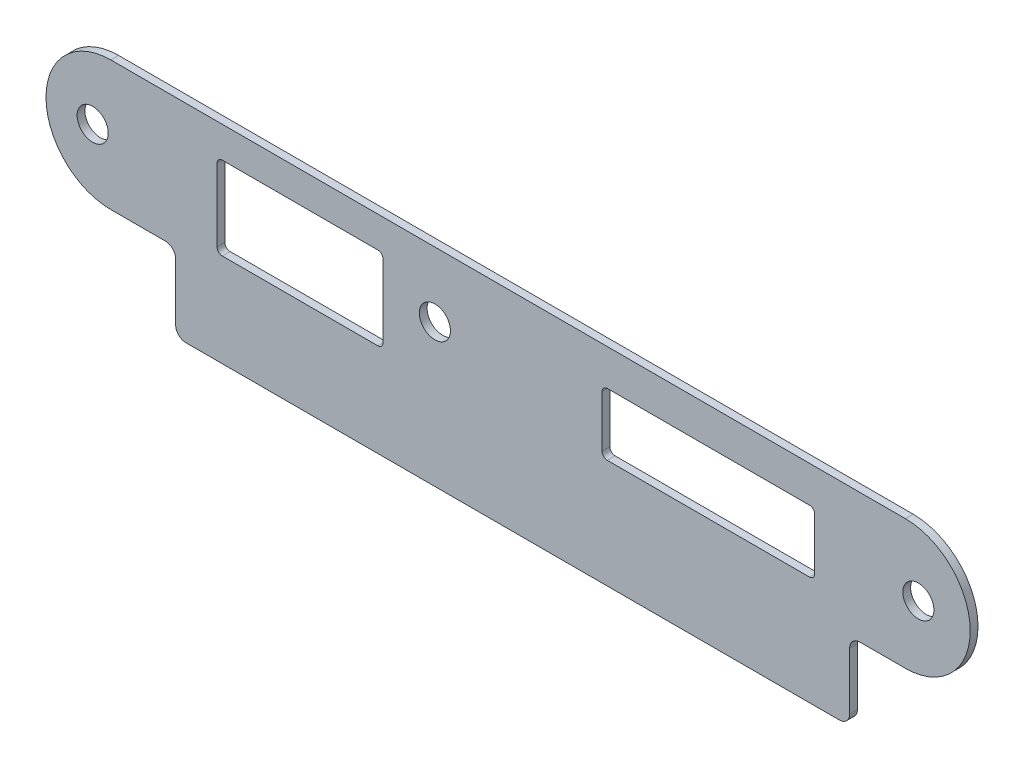
ISO-10303-21;
HEADER;
FILE_DESCRIPTION(('STEP AP214'),'2;1');
FILE_NAME('part.step','',(''),(''),'','','');
FILE_SCHEMA(('AUTOMOTIVE_DESIGN { 1 0 10303 214 1 1 1 1 }'));
ENDSEC;
DATA;
#1=APPLICATION_CONTEXT('core data for automotive mechanical design processes');
#2=APPLICATION_PROTOCOL_DEFINITION('international standard','automotive_design',2000,#1);
#3=PRODUCT_CONTEXT('',#1,'mechanical');
#4=PRODUCT('Part','Part','',(#3));
#5=PRODUCT_RELATED_PRODUCT_CATEGORY('part','',(#4));
#6=PRODUCT_DEFINITION_FORMATION('','',#4);
#7=PRODUCT_DEFINITION_CONTEXT('part definition',#1,'design');
#8=PRODUCT_DEFINITION('design','',#6,#7);
#9=PRODUCT_DEFINITION_SHAPE('','',#8);
#10=(LENGTH_UNIT() NAMED_UNIT(*) SI_UNIT(.MILLI.,.METRE.));
#11=(NAMED_UNIT(*) PLANE_ANGLE_UNIT() SI_UNIT($,.RADIAN.));
#12=(NAMED_UNIT(*) SI_UNIT($,.STERADIAN.) SOLID_ANGLE_UNIT());
#13=UNCERTAINTY_MEASURE_WITH_UNIT(LENGTH_MEASURE(1.E-05),#10,'distance_accuracy_value','');
#14=(GEOMETRIC_REPRESENTATION_CONTEXT(3) GLOBAL_UNCERTAINTY_ASSIGNED_CONTEXT((#13)) GLOBAL_UNIT_ASSIGNED_CONTEXT((#10,
#11,#12)) REPRESENTATION_CONTEXT('',''));
#15=CARTESIAN_POINT('',(0.,0.,0.));
#16=DIRECTION('',(0.,0.,1.));
#17=DIRECTION('',(1.,0.,0.));
#18=AXIS2_PLACEMENT_3D('',#15,#16,#17);
#19=CARTESIAN_POINT('',(-83.,6.50000000000004,1.5));
#20=DIRECTION('',(0.,0.,1.));
#21=DIRECTION('',(1.,0.,0.));
#22=AXIS2_PLACEMENT_3D('',#19,#20,#21);
#23=PLANE('',#22);
#24=DIRECTION('',(-1.,0.,0.));
#25=VECTOR('',#24,1.);
#26=CARTESIAN_POINT('',(51.75,12.0000000000001,1.5));
#27=LINE('',#26,#25);
#28=CARTESIAN_POINT('',(51.75,12.0000000000001,1.5));
#29=VERTEX_POINT('',#28);
#30=CARTESIAN_POINT('',(12.75,12.,1.5));
#31=VERTEX_POINT('',#30);
#32=EDGE_CURVE('E229',#29,#31,#27,.T.);
#33=ORIENTED_EDGE('',*,*,#32,.F.);
#34=CARTESIAN_POINT('',(51.75,11.,1.5));
#35=DIRECTION('',(0.,0.,1.));
#36=DIRECTION('',(1.,0.,0.));
#37=AXIS2_PLACEMENT_3D('',#34,#35,#36);
#38=CIRCLE('',#37,1.00000000000002);
#39=CARTESIAN_POINT('',(52.75,11.,1.5));
#40=VERTEX_POINT('',#39);
#41=EDGE_CURVE('E221',#40,#29,#38,.T.);
#42=ORIENTED_EDGE('',*,*,#41,.F.);
#43=DIRECTION('',(0.,1.,0.));
#44=VECTOR('',#43,1.);
#45=CARTESIAN_POINT('',(52.75,1.00000000000005,1.5));
#46=LINE('',#45,#44);
#47=CARTESIAN_POINT('',(52.75,1.00000000000005,1.5));
#48=VERTEX_POINT('',#47);
#49=EDGE_CURVE('E256',#48,#40,#46,.T.);
#50=ORIENTED_EDGE('',*,*,#49,.F.);
#51=CARTESIAN_POINT('',(51.75,1.00000000000004,1.5));
#52=DIRECTION('',(0.,0.,1.));
#53=DIRECTION('',(1.,0.,0.));
#54=AXIS2_PLACEMENT_3D('',#51,#52,#53);
#55=CIRCLE('',#54,0.999999999999997);
#56=CARTESIAN_POINT('',(51.75,0.,1.5));
#57=VERTEX_POINT('',#56);
#58=EDGE_CURVE('E254',#57,#48,#55,.T.);
#59=ORIENTED_EDGE('',*,*,#58,.F.);
#60=DIRECTION('',(1.,0.,0.));
#61=VECTOR('',#60,1.);
#62=CARTESIAN_POINT('',(12.75,0.,1.5));
#63=LINE('',#62,#61);
#64=CARTESIAN_POINT('',(12.75,0.,1.5));
#65=VERTEX_POINT('',#64);
#66=EDGE_CURVE('E252',#65,#57,#63,.T.);
#67=ORIENTED_EDGE('',*,*,#66,.F.);
#68=CARTESIAN_POINT('',(12.75,1.00000000000004,1.5));
#69=DIRECTION('',(0.,0.,1.));
#70=DIRECTION('',(1.,0.,0.));
#71=AXIS2_PLACEMENT_3D('',#68,#69,#70);
#72=CIRCLE('',#71,0.999999999999999);
#73=CARTESIAN_POINT('',(11.75,1.00000000000004,1.5));
#74=VERTEX_POINT('',#73);
#75=EDGE_CURVE('E250',#74,#65,#72,.T.);
#76=ORIENTED_EDGE('',*,*,#75,.F.);
#77=DIRECTION('',(0.,-1.,0.));
#78=VECTOR('',#77,1.);
#79=CARTESIAN_POINT('',(11.75,11.,1.5));
#80=LINE('',#79,#78);
#81=CARTESIAN_POINT('',(11.75,11.,1.5));
#82=VERTEX_POINT('',#81);
#83=EDGE_CURVE('E245',#82,#74,#80,.T.);
#84=ORIENTED_EDGE('',*,*,#83,.F.);
#85=CARTESIAN_POINT('',(12.75,11.,1.5));
#86=DIRECTION('',(0.,0.,1.));
#87=DIRECTION('',(1.,0.,0.));
#88=AXIS2_PLACEMENT_3D('',#85,#86,#87);
#89=CIRCLE('',#88,1.);
#90=EDGE_CURVE('E243',#31,#82,#89,.T.);
#91=ORIENTED_EDGE('',*,*,#90,.F.);
#92=EDGE_LOOP('',(#33,#42,#50,#59,#67,#76,#84,#91));
#93=FACE_BOUND('',#92,.T.);
#94=DIRECTION('',(0.,-1.,0.));
#95=VECTOR('',#94,1.);
#96=CARTESIAN_POINT('',(-62.5,12.,1.5));
#97=LINE('',#96,#95);
#98=CARTESIAN_POINT('',(-62.5,12.,1.5));
#99=VERTEX_POINT('',#98);
#100=CARTESIAN_POINT('',(-62.5,-2.00000000000002,1.5));
#101=VERTEX_POINT('',#100);
#102=EDGE_CURVE('E297',#99,#101,#97,.T.);
#103=ORIENTED_EDGE('',*,*,#102,.F.);
#104=CARTESIAN_POINT('',(-61.5,12.,1.5));
#105=DIRECTION('',(0.,0.,1.));
#106=DIRECTION('',(1.,0.,0.));
#107=AXIS2_PLACEMENT_3D('',#104,#105,#106);
#108=CIRCLE('',#107,1.);
#109=CARTESIAN_POINT('',(-61.5,13.,1.5));
#110=VERTEX_POINT('',#109);
#111=EDGE_CURVE('E295',#110,#99,#108,.T.);
#112=ORIENTED_EDGE('',*,*,#111,.F.);
#113=DIRECTION('',(-1.,0.,0.));
#114=VECTOR('',#113,1.);
#115=CARTESIAN_POINT('',(-31.5,13.,1.5));
#116=LINE('',#115,#114);
#117=CARTESIAN_POINT('',(-31.5,13.,1.5));
#118=VERTEX_POINT('',#117);
#119=EDGE_CURVE('E311',#118,#110,#116,.T.);
#120=ORIENTED_EDGE('',*,*,#119,.F.);
#121=CARTESIAN_POINT('',(-31.5,12.,1.5));
#122=DIRECTION('',(0.,0.,1.));
#123=DIRECTION('',(1.,0.,0.));
#124=AXIS2_PLACEMENT_3D('',#121,#122,#123);
#125=CIRCLE('',#124,0.999999999999991);
#126=CARTESIAN_POINT('',(-30.5,12.,1.5));
#127=VERTEX_POINT('',#126);
#128=EDGE_CURVE('E308',#127,#118,#125,.T.);
#129=ORIENTED_EDGE('',*,*,#128,.F.);
#130=DIRECTION('',(0.,1.,0.));
#131=VECTOR('',#130,1.);
#132=CARTESIAN_POINT('',(-30.5,-2.00000000000002,1.5));
#133=LINE('',#132,#131);
#134=CARTESIAN_POINT('',(-30.5,-2.00000000000002,1.5));
#135=VERTEX_POINT('',#134);
#136=EDGE_CURVE('E306',#135,#127,#133,.T.);
#137=ORIENTED_EDGE('',*,*,#136,.F.);
#138=CARTESIAN_POINT('',(-31.5,-2.00000000000002,1.5));
#139=DIRECTION('',(0.,0.,1.));
#140=DIRECTION('',(1.,0.,0.));
#141=AXIS2_PLACEMENT_3D('',#138,#139,#140);
#142=CIRCLE('',#141,1.);
#143=CARTESIAN_POINT('',(-31.5,-3.00000000000002,1.5));
#144=VERTEX_POINT('',#143);
#145=EDGE_CURVE('E304',#144,#135,#142,.T.);
#146=ORIENTED_EDGE('',*,*,#145,.F.);
#147=DIRECTION('',(1.,0.,0.));
#148=VECTOR('',#147,1.);
#149=CARTESIAN_POINT('',(-61.5,-3.00000000000003,1.5));
#150=LINE('',#149,#148);
#151=CARTESIAN_POINT('',(-61.5,-3.00000000000003,1.5));
#152=VERTEX_POINT('',#151);
#153=EDGE_CURVE('E302',#152,#144,#150,.T.);
#154=ORIENTED_EDGE('',*,*,#153,.F.);
#155=CARTESIAN_POINT('',(-61.5,-2.00000000000003,1.5));
#156=DIRECTION('',(0.,0.,1.));
#157=DIRECTION('',(1.,0.,0.));
#158=AXIS2_PLACEMENT_3D('',#155,#156,#157);
#159=CIRCLE('',#158,1.);
#160=EDGE_CURVE('E300',#101,#152,#159,.T.);
#161=ORIENTED_EDGE('',*,*,#160,.F.);
#162=EDGE_LOOP('',(#103,#112,#120,#129,#137,#146,#154,#161));
#163=FACE_BOUND('',#162,.T.);
#164=CARTESIAN_POINT('',(-83.,6.50000000000004,1.5));
#165=DIRECTION('',(0.,0.,1.));
#166=DIRECTION('',(1.,0.,0.));
#167=AXIS2_PLACEMENT_3D('',#164,#165,#166);
#168=CIRCLE('',#167,12.5);
#169=CARTESIAN_POINT('',(-83.,19.,1.5));
#170=VERTEX_POINT('',#169);
#171=CARTESIAN_POINT('',(-83.,-5.99999999999994,1.5));
#172=VERTEX_POINT('',#171);
#173=EDGE_CURVE('E361',#170,#172,#168,.T.);
#174=ORIENTED_EDGE('',*,*,#173,.T.);
#175=DIRECTION('',(1.,0.,0.));
#176=VECTOR('',#175,1.);
#177=CARTESIAN_POINT('',(-83.,-5.99999999999994,1.5));
#178=LINE('',#177,#176);
#179=CARTESIAN_POINT('',(-72.5,-6.00000000000005,1.5));
#180=VERTEX_POINT('',#179);
#181=EDGE_CURVE('E364',#172,#180,#178,.T.);
#182=ORIENTED_EDGE('',*,*,#181,.T.);
#183=CARTESIAN_POINT('',(-72.5,-8.00000000000005,1.5));
#184=DIRECTION('',(0.,0.,-1.));
#185=DIRECTION('',(1.,0.,0.));
#186=AXIS2_PLACEMENT_3D('',#183,#184,#185);
#187=CIRCLE('',#186,2.);
#188=CARTESIAN_POINT('',(-70.5,-8.00000000000005,1.5));
#189=VERTEX_POINT('',#188);
#190=EDGE_CURVE('E367',#180,#189,#187,.T.);
#191=ORIENTED_EDGE('',*,*,#190,.T.);
#192=DIRECTION('',(0.,-1.,0.));
#193=VECTOR('',#192,1.);
#194=CARTESIAN_POINT('',(-70.5,-8.00000000000005,1.5));
#195=LINE('',#194,#193);
#196=CARTESIAN_POINT('',(-70.5,-19.,1.5));
#197=VERTEX_POINT('',#196);
#198=EDGE_CURVE('E369',#189,#197,#195,.T.);
#199=ORIENTED_EDGE('',*,*,#198,.T.);
#200=CARTESIAN_POINT('',(-68.5,-19.,1.5));
#201=DIRECTION('',(0.,0.,1.));
#202=DIRECTION('',(1.,0.,0.));
#203=AXIS2_PLACEMENT_3D('',#200,#201,#202);
#204=CIRCLE('',#203,2.00000000000001);
#205=CARTESIAN_POINT('',(-68.5,-21.,1.5));
#206=VERTEX_POINT('',#205);
#207=EDGE_CURVE('E371',#197,#206,#204,.T.);
#208=ORIENTED_EDGE('',*,*,#207,.T.);
#209=DIRECTION('',(1.,0.,0.));
#210=VECTOR('',#209,1.);
#211=CARTESIAN_POINT('',(-68.5,-21.,1.5));
#212=LINE('',#211,#210);
#213=CARTESIAN_POINT('',(57.5,-20.9999999999999,1.5));
#214=VERTEX_POINT('',#213);
#215=EDGE_CURVE('E373',#206,#214,#212,.T.);
#216=ORIENTED_EDGE('',*,*,#215,.T.);
#217=CARTESIAN_POINT('',(57.5,-18.9999999999999,1.5));
#218=DIRECTION('',(0.,0.,1.));
#219=DIRECTION('',(1.,0.,0.));
#220=AXIS2_PLACEMENT_3D('',#217,#218,#219);
#221=CIRCLE('',#220,1.99999999999999);
#222=CARTESIAN_POINT('',(59.5,-18.9999999999999,1.5));
#223=VERTEX_POINT('',#222);
#224=EDGE_CURVE('E375',#214,#223,#221,.T.);
#225=ORIENTED_EDGE('',*,*,#224,.T.);
#226=DIRECTION('',(0.,1.,0.));
#227=VECTOR('',#226,1.);
#228=CARTESIAN_POINT('',(59.5,-18.9999999999999,1.5));
#229=LINE('',#228,#227);
#230=CARTESIAN_POINT('',(59.5,-7.99999999999995,1.5));
#231=VERTEX_POINT('',#230);
#232=EDGE_CURVE('E377',#223,#231,#229,.T.);
#233=ORIENTED_EDGE('',*,*,#232,.T.);
#234=CARTESIAN_POINT('',(61.5,-7.99999999999995,1.5));
#235=DIRECTION('',(0.,0.,-1.));
#236=DIRECTION('',(1.,0.,0.));
#237=AXIS2_PLACEMENT_3D('',#234,#235,#236);
#238=CIRCLE('',#237,2.);
#239=CARTESIAN_POINT('',(61.5,-5.99999999999995,1.5));
#240=VERTEX_POINT('',#239);
#241=EDGE_CURVE('E379',#231,#240,#238,.T.);
#242=ORIENTED_EDGE('',*,*,#241,.T.);
#243=DIRECTION('',(1.,0.,0.));
#244=VECTOR('',#243,1.);
#245=CARTESIAN_POINT('',(61.5,-5.99999999999995,1.5));
#246=LINE('',#245,#244);
#247=CARTESIAN_POINT('',(70.25,-5.99999999999994,1.5));
#248=VERTEX_POINT('',#247);
#249=EDGE_CURVE('E381',#240,#248,#246,.T.);
#250=ORIENTED_EDGE('',*,*,#249,.T.);
#251=CARTESIAN_POINT('',(70.25,6.50000000000006,1.5));
#252=DIRECTION('',(0.,0.,1.));
#253=DIRECTION('',(1.,0.,0.));
#254=AXIS2_PLACEMENT_3D('',#251,#252,#253);
#255=CIRCLE('',#254,12.5);
#256=CARTESIAN_POINT('',(70.25,19.0000000000001,1.5));
#257=VERTEX_POINT('',#256);
#258=EDGE_CURVE('E383',#248,#257,#255,.T.);
#259=ORIENTED_EDGE('',*,*,#258,.T.);
#260=DIRECTION('',(-1.,0.,0.));
#261=VECTOR('',#260,1.);
#262=CARTESIAN_POINT('',(70.25,19.0000000000001,1.5));
#263=LINE('',#262,#261);
#264=EDGE_CURVE('E385',#257,#170,#263,.T.);
#265=ORIENTED_EDGE('',*,*,#264,.T.);
#266=EDGE_LOOP('',(#174,#182,#191,#199,#208,#216,#225,#233,#242,#250,#259,#265));
#267=FACE_BOUND('',#266,.T.);
#268=CARTESIAN_POINT('',(-86.5,6.49999999999999,1.5));
#269=DIRECTION('',(0.,0.,1.));
#270=DIRECTION('',(1.,0.,0.));
#271=AXIS2_PLACEMENT_3D('',#268,#269,#270);
#272=CIRCLE('',#271,3.00000000000001);
#273=CARTESIAN_POINT('',(-83.5,6.49999999999999,1.5));
#274=VERTEX_POINT('',#273);
#275=EDGE_CURVE('E355',#274,#274,#272,.T.);
#276=ORIENTED_EDGE('',*,*,#275,.F.);
#277=EDGE_LOOP('',(#276));
#278=FACE_BOUND('',#277,.T.);
#279=CARTESIAN_POINT('',(-20.5,6.50000000000004,1.5));
#280=DIRECTION('',(0.,0.,1.));
#281=DIRECTION('',(1.,0.,0.));
#282=AXIS2_PLACEMENT_3D('',#279,#280,#281);
#283=CIRCLE('',#282,3.);
#284=CARTESIAN_POINT('',(-17.5,6.50000000000004,1.5));
#285=VERTEX_POINT('',#284);
#286=EDGE_CURVE('E289',#285,#285,#283,.T.);
#287=ORIENTED_EDGE('',*,*,#286,.F.);
#288=EDGE_LOOP('',(#287));
#289=FACE_BOUND('',#288,.T.);
#290=CARTESIAN_POINT('',(72.75,6.50000000000006,1.5));
#291=DIRECTION('',(0.,0.,1.));
#292=DIRECTION('',(1.,0.,0.));
#293=AXIS2_PLACEMENT_3D('',#290,#291,#292);
#294=CIRCLE('',#293,3.00000000000001);
#295=CARTESIAN_POINT('',(75.75,6.50000000000006,1.5));
#296=VERTEX_POINT('',#295);
#297=EDGE_CURVE('E259',#296,#296,#294,.T.);
#298=ORIENTED_EDGE('',*,*,#297,.F.);
#299=EDGE_LOOP('',(#298));
#300=FACE_BOUND('',#299,.T.);
#301=ADVANCED_FACE('F36',(#93,#163,#267,#278,#289,#300),#23,.T.);
#302=CARTESIAN_POINT('',(-83.,6.50000000000004,0.));
#303=DIRECTION('',(0.,0.,1.));
#304=DIRECTION('',(1.,0.,0.));
#305=AXIS2_PLACEMENT_3D('',#302,#303,#304);
#306=PLANE('',#305);
#307=CARTESIAN_POINT('',(51.75,11.,0.));
#308=DIRECTION('',(0.,0.,1.));
#309=DIRECTION('',(1.,0.,0.));
#310=AXIS2_PLACEMENT_3D('',#307,#308,#309);
#311=CIRCLE('',#310,1.00000000000002);
#312=CARTESIAN_POINT('',(52.75,11.,0.));
#313=VERTEX_POINT('',#312);
#314=CARTESIAN_POINT('',(51.75,12.0000000000001,0.));
#315=VERTEX_POINT('',#314);
#316=EDGE_CURVE('E59',#313,#315,#311,.T.);
#317=ORIENTED_EDGE('',*,*,#316,.T.);
#318=DIRECTION('',(-1.,0.,0.));
#319=VECTOR('',#318,1.);
#320=CARTESIAN_POINT('',(51.75,12.0000000000001,0.));
#321=LINE('',#320,#319);
#322=CARTESIAN_POINT('',(12.75,12.,0.));
#323=VERTEX_POINT('',#322);
#324=EDGE_CURVE('E236',#315,#323,#321,.T.);
#325=ORIENTED_EDGE('',*,*,#324,.T.);
#326=CARTESIAN_POINT('',(12.75,11.,0.));
#327=DIRECTION('',(0.,0.,1.));
#328=DIRECTION('',(1.,0.,0.));
#329=AXIS2_PLACEMENT_3D('',#326,#327,#328);
#330=CIRCLE('',#329,1.);
#331=CARTESIAN_POINT('',(11.75,11.,0.));
#332=VERTEX_POINT('',#331);
#333=EDGE_CURVE('E261',#323,#332,#330,.T.);
#334=ORIENTED_EDGE('',*,*,#333,.T.);
#335=DIRECTION('',(0.,-1.,0.));
#336=VECTOR('',#335,1.);
#337=CARTESIAN_POINT('',(11.75,11.,0.));
#338=LINE('',#337,#336);
#339=CARTESIAN_POINT('',(11.75,1.00000000000004,0.));
#340=VERTEX_POINT('',#339);
#341=EDGE_CURVE('E264',#332,#340,#338,.T.);
#342=ORIENTED_EDGE('',*,*,#341,.T.);
#343=CARTESIAN_POINT('',(12.75,1.00000000000004,0.));
#344=DIRECTION('',(0.,0.,1.));
#345=DIRECTION('',(1.,0.,0.));
#346=AXIS2_PLACEMENT_3D('',#343,#344,#345);
#347=CIRCLE('',#346,0.999999999999999);
#348=CARTESIAN_POINT('',(12.75,0.,0.));
#349=VERTEX_POINT('',#348);
#350=EDGE_CURVE('E267',#340,#349,#347,.T.);
#351=ORIENTED_EDGE('',*,*,#350,.T.);
#352=DIRECTION('',(1.,0.,0.));
#353=VECTOR('',#352,1.);
#354=CARTESIAN_POINT('',(12.75,0.,0.));
#355=LINE('',#354,#353);
#356=CARTESIAN_POINT('',(51.75,0.,0.));
#357=VERTEX_POINT('',#356);
#358=EDGE_CURVE('E270',#349,#357,#355,.T.);
#359=ORIENTED_EDGE('',*,*,#358,.T.);
#360=CARTESIAN_POINT('',(51.75,1.00000000000004,0.));
#361=DIRECTION('',(0.,0.,1.));
#362=DIRECTION('',(1.,0.,0.));
#363=AXIS2_PLACEMENT_3D('',#360,#361,#362);
#364=CIRCLE('',#363,0.999999999999997);
#365=CARTESIAN_POINT('',(52.75,1.00000000000005,0.));
#366=VERTEX_POINT('',#365);
#367=EDGE_CURVE('E273',#357,#366,#364,.T.);
#368=ORIENTED_EDGE('',*,*,#367,.T.);
#369=DIRECTION('',(0.,1.,0.));
#370=VECTOR('',#369,1.);
#371=CARTESIAN_POINT('',(52.75,1.00000000000005,0.));
#372=LINE('',#371,#370);
#373=EDGE_CURVE('E230',#366,#313,#372,.T.);
#374=ORIENTED_EDGE('',*,*,#373,.T.);
#375=EDGE_LOOP('',(#317,#325,#334,#342,#351,#359,#368,#374));
#376=FACE_BOUND('',#375,.T.);
#377=CARTESIAN_POINT('',(-61.5,12.,0.));
#378=DIRECTION('',(0.,0.,1.));
#379=DIRECTION('',(1.,0.,0.));
#380=AXIS2_PLACEMENT_3D('',#377,#378,#379);
#381=CIRCLE('',#380,1.);
#382=CARTESIAN_POINT('',(-61.5,13.,0.));
#383=VERTEX_POINT('',#382);
#384=CARTESIAN_POINT('',(-62.5,12.,0.));
#385=VERTEX_POINT('',#384);
#386=EDGE_CURVE('E292',#383,#385,#381,.T.);
#387=ORIENTED_EDGE('',*,*,#386,.T.);
#388=DIRECTION('',(0.,-1.,0.));
#389=VECTOR('',#388,1.);
#390=CARTESIAN_POINT('',(-62.5,12.,0.));
#391=LINE('',#390,#389);
#392=CARTESIAN_POINT('',(-62.5,-2.00000000000002,0.));
#393=VERTEX_POINT('',#392);
#394=EDGE_CURVE('E315',#385,#393,#391,.T.);
#395=ORIENTED_EDGE('',*,*,#394,.T.);
#396=CARTESIAN_POINT('',(-61.5,-2.00000000000003,0.));
#397=DIRECTION('',(0.,0.,1.));
#398=DIRECTION('',(1.,0.,0.));
#399=AXIS2_PLACEMENT_3D('',#396,#397,#398);
#400=CIRCLE('',#399,1.);
#401=CARTESIAN_POINT('',(-61.5,-3.00000000000003,0.));
#402=VERTEX_POINT('',#401);
#403=EDGE_CURVE('E320',#393,#402,#400,.T.);
#404=ORIENTED_EDGE('',*,*,#403,.T.);
#405=DIRECTION('',(1.,0.,0.));
#406=VECTOR('',#405,1.);
#407=CARTESIAN_POINT('',(-61.5,-3.00000000000003,0.));
#408=LINE('',#407,#406);
#409=CARTESIAN_POINT('',(-31.5,-3.00000000000002,0.));
#410=VERTEX_POINT('',#409);
#411=EDGE_CURVE('E323',#402,#410,#408,.T.);
#412=ORIENTED_EDGE('',*,*,#411,.T.);
#413=CARTESIAN_POINT('',(-31.5,-2.00000000000002,0.));
#414=DIRECTION('',(0.,0.,1.));
#415=DIRECTION('',(1.,0.,0.));
#416=AXIS2_PLACEMENT_3D('',#413,#414,#415);
#417=CIRCLE('',#416,1.);
#418=CARTESIAN_POINT('',(-30.5,-2.00000000000002,0.));
#419=VERTEX_POINT('',#418);
#420=EDGE_CURVE('E326',#410,#419,#417,.T.);
#421=ORIENTED_EDGE('',*,*,#420,.T.);
#422=DIRECTION('',(0.,1.,0.));
#423=VECTOR('',#422,1.);
#424=CARTESIAN_POINT('',(-30.5,-2.00000000000002,0.));
#425=LINE('',#424,#423);
#426=CARTESIAN_POINT('',(-30.5,12.,0.));
#427=VERTEX_POINT('',#426);
#428=EDGE_CURVE('E329',#419,#427,#425,.T.);
#429=ORIENTED_EDGE('',*,*,#428,.T.);
#430=CARTESIAN_POINT('',(-31.5,12.,0.));
#431=DIRECTION('',(0.,0.,1.));
#432=DIRECTION('',(1.,0.,0.));
#433=AXIS2_PLACEMENT_3D('',#430,#431,#432);
#434=CIRCLE('',#433,0.999999999999991);
#435=CARTESIAN_POINT('',(-31.5,13.,0.));
#436=VERTEX_POINT('',#435);
#437=EDGE_CURVE('E332',#427,#436,#434,.T.);
#438=ORIENTED_EDGE('',*,*,#437,.T.);
#439=DIRECTION('',(-1.,0.,0.));
#440=VECTOR('',#439,1.);
#441=CARTESIAN_POINT('',(-31.5,13.,0.));
#442=LINE('',#441,#440);
#443=EDGE_CURVE('E298',#436,#383,#442,.T.);
#444=ORIENTED_EDGE('',*,*,#443,.T.);
#445=EDGE_LOOP('',(#387,#395,#404,#412,#421,#429,#438,#444));
#446=FACE_BOUND('',#445,.T.);
#447=CARTESIAN_POINT('',(-83.,6.50000000000004,0.));
#448=DIRECTION('',(0.,0.,1.));
#449=DIRECTION('',(1.,0.,0.));
#450=AXIS2_PLACEMENT_3D('',#447,#448,#449);
#451=CIRCLE('',#450,12.5);
#452=CARTESIAN_POINT('',(-83.,19.,0.));
#453=VERTEX_POINT('',#452);
#454=CARTESIAN_POINT('',(-83.,-5.99999999999994,0.));
#455=VERTEX_POINT('',#454);
#456=EDGE_CURVE('E358',#453,#455,#451,.T.);
#457=ORIENTED_EDGE('',*,*,#456,.F.);
#458=DIRECTION('',(-1.,0.,0.));
#459=VECTOR('',#458,1.);
#460=CARTESIAN_POINT('',(70.25,19.0000000000001,0.));
#461=LINE('',#460,#459);
#462=CARTESIAN_POINT('',(70.25,19.0000000000001,0.));
#463=VERTEX_POINT('',#462);
#464=EDGE_CURVE('E365',#463,#453,#461,.T.);
#465=ORIENTED_EDGE('',*,*,#464,.F.);
#466=CARTESIAN_POINT('',(70.25,6.50000000000006,0.));
#467=DIRECTION('',(0.,0.,1.));
#468=DIRECTION('',(1.,0.,0.));
#469=AXIS2_PLACEMENT_3D('',#466,#467,#468);
#470=CIRCLE('',#469,12.5);
#471=CARTESIAN_POINT('',(70.25,-5.99999999999994,0.));
#472=VERTEX_POINT('',#471);
#473=EDGE_CURVE('E408',#472,#463,#470,.T.);
#474=ORIENTED_EDGE('',*,*,#473,.F.);
#475=DIRECTION('',(1.,0.,0.));
#476=VECTOR('',#475,1.);
#477=CARTESIAN_POINT('',(61.5,-5.99999999999995,0.));
#478=LINE('',#477,#476);
#479=CARTESIAN_POINT('',(61.5,-5.99999999999995,0.));
#480=VERTEX_POINT('',#479);
#481=EDGE_CURVE('E406',#480,#472,#478,.T.);
#482=ORIENTED_EDGE('',*,*,#481,.F.);
#483=CARTESIAN_POINT('',(61.5,-7.99999999999995,0.));
#484=DIRECTION('',(0.,0.,-1.));
#485=DIRECTION('',(1.,0.,0.));
#486=AXIS2_PLACEMENT_3D('',#483,#484,#485);
#487=CIRCLE('',#486,2.);
#488=CARTESIAN_POINT('',(59.5,-7.99999999999995,0.));
#489=VERTEX_POINT('',#488);
#490=EDGE_CURVE('E404',#489,#480,#487,.T.);
#491=ORIENTED_EDGE('',*,*,#490,.F.);
#492=DIRECTION('',(0.,1.,0.));
#493=VECTOR('',#492,1.);
#494=CARTESIAN_POINT('',(59.5,-18.9999999999999,0.));
#495=LINE('',#494,#493);
#496=CARTESIAN_POINT('',(59.5,-18.9999999999999,0.));
#497=VERTEX_POINT('',#496);
#498=EDGE_CURVE('E402',#497,#489,#495,.T.);
#499=ORIENTED_EDGE('',*,*,#498,.F.);
#500=CARTESIAN_POINT('',(57.5,-18.9999999999999,0.));
#501=DIRECTION('',(0.,0.,1.));
#502=DIRECTION('',(1.,0.,0.));
#503=AXIS2_PLACEMENT_3D('',#500,#501,#502);
#504=CIRCLE('',#503,1.99999999999999);
#505=CARTESIAN_POINT('',(57.5,-20.9999999999999,0.));
#506=VERTEX_POINT('',#505);
#507=EDGE_CURVE('E400',#506,#497,#504,.T.);
#508=ORIENTED_EDGE('',*,*,#507,.F.);
#509=DIRECTION('',(1.,0.,0.));
#510=VECTOR('',#509,1.);
#511=CARTESIAN_POINT('',(-68.5,-21.,0.));
#512=LINE('',#511,#510);
#513=CARTESIAN_POINT('',(-68.5,-21.,0.));
#514=VERTEX_POINT('',#513);
#515=EDGE_CURVE('E398',#514,#506,#512,.T.);
#516=ORIENTED_EDGE('',*,*,#515,.F.);
#517=CARTESIAN_POINT('',(-68.5,-19.,0.));
#518=DIRECTION('',(0.,0.,1.));
#519=DIRECTION('',(1.,0.,0.));
#520=AXIS2_PLACEMENT_3D('',#517,#518,#519);
#521=CIRCLE('',#520,2.00000000000001);
#522=CARTESIAN_POINT('',(-70.5,-19.,0.));
#523=VERTEX_POINT('',#522);
#524=EDGE_CURVE('E396',#523,#514,#521,.T.);
#525=ORIENTED_EDGE('',*,*,#524,.F.);
#526=DIRECTION('',(0.,-1.,0.));
#527=VECTOR('',#526,1.);
#528=CARTESIAN_POINT('',(-70.5,-8.00000000000005,0.));
#529=LINE('',#528,#527);
#530=CARTESIAN_POINT('',(-70.5,-8.00000000000005,0.));
#531=VERTEX_POINT('',#530);
#532=EDGE_CURVE('E394',#531,#523,#529,.T.);
#533=ORIENTED_EDGE('',*,*,#532,.F.);
#534=CARTESIAN_POINT('',(-72.5,-8.00000000000005,0.));
#535=DIRECTION('',(0.,0.,-1.));
#536=DIRECTION('',(1.,0.,0.));
#537=AXIS2_PLACEMENT_3D('',#534,#535,#536);
#538=CIRCLE('',#537,2.);
#539=CARTESIAN_POINT('',(-72.5,-6.00000000000005,0.));
#540=VERTEX_POINT('',#539);
#541=EDGE_CURVE('E392',#540,#531,#538,.T.);
#542=ORIENTED_EDGE('',*,*,#541,.F.);
#543=DIRECTION('',(1.,0.,0.));
#544=VECTOR('',#543,1.);
#545=CARTESIAN_POINT('',(-83.,-5.99999999999994,0.));
#546=LINE('',#545,#544);
#547=EDGE_CURVE('E390',#455,#540,#546,.T.);
#548=ORIENTED_EDGE('',*,*,#547,.F.);
#549=EDGE_LOOP('',(#457,#465,#474,#482,#491,#499,#508,#516,#525,#533,#542,#548));
#550=FACE_BOUND('',#549,.T.);
#551=CARTESIAN_POINT('',(-86.5,6.49999999999999,0.));
#552=DIRECTION('',(0.,0.,1.));
#553=DIRECTION('',(1.,0.,0.));
#554=AXIS2_PLACEMENT_3D('',#551,#552,#553);
#555=CIRCLE('',#554,3.00000000000001);
#556=CARTESIAN_POINT('',(-83.5,6.49999999999999,0.));
#557=VERTEX_POINT('',#556);
#558=EDGE_CURVE('E354',#557,#557,#555,.T.);
#559=ORIENTED_EDGE('',*,*,#558,.T.);
#560=EDGE_LOOP('',(#559));
#561=FACE_BOUND('',#560,.T.);
#562=CARTESIAN_POINT('',(-20.5,6.50000000000004,0.));
#563=DIRECTION('',(0.,0.,1.));
#564=DIRECTION('',(1.,0.,0.));
#565=AXIS2_PLACEMENT_3D('',#562,#563,#564);
#566=CIRCLE('',#565,3.);
#567=CARTESIAN_POINT('',(-17.5,6.50000000000004,0.));
#568=VERTEX_POINT('',#567);
#569=EDGE_CURVE('E237',#568,#568,#566,.T.);
#570=ORIENTED_EDGE('',*,*,#569,.T.);
#571=EDGE_LOOP('',(#570));
#572=FACE_BOUND('',#571,.T.);
#573=CARTESIAN_POINT('',(72.75,6.50000000000006,0.));
#574=DIRECTION('',(0.,0.,1.));
#575=DIRECTION('',(1.,0.,0.));
#576=AXIS2_PLACEMENT_3D('',#573,#574,#575);
#577=CIRCLE('',#576,3.00000000000001);
#578=CARTESIAN_POINT('',(75.75,6.50000000000006,0.));
#579=VERTEX_POINT('',#578);
#580=EDGE_CURVE('E803',#579,#579,#577,.T.);
#581=ORIENTED_EDGE('',*,*,#580,.T.);
#582=EDGE_LOOP('',(#581));
#583=FACE_BOUND('',#582,.T.);
#584=ADVANCED_FACE('F450',(#376,#446,#550,#561,#572,#583),#306,.F.);
#585=CARTESIAN_POINT('',(-83.,6.50000000000004,1.5));
#586=DIRECTION('',(0.,0.,-1.));
#587=DIRECTION('',(-1.,0.,0.));
#588=AXIS2_PLACEMENT_3D('',#585,#586,#587);
#589=CYLINDRICAL_SURFACE('',#588,12.5);
#590=ORIENTED_EDGE('',*,*,#456,.T.);
#591=DIRECTION('',(0.,0.,-1.));
#592=VECTOR('',#591,1.);
#593=CARTESIAN_POINT('',(-83.,-5.99999999999994,1.5));
#594=LINE('',#593,#592);
#595=EDGE_CURVE('E12',#172,#455,#594,.T.);
#596=ORIENTED_EDGE('',*,*,#595,.F.);
#597=ORIENTED_EDGE('',*,*,#173,.F.);
#598=DIRECTION('',(0.,0.,-1.));
#599=VECTOR('',#598,1.);
#600=CARTESIAN_POINT('',(-83.,19.,1.5));
#601=LINE('',#600,#599);
#602=EDGE_CURVE('E387',#170,#453,#601,.T.);
#603=ORIENTED_EDGE('',*,*,#602,.T.);
#604=EDGE_LOOP('',(#590,#596,#597,#603));
#605=FACE_BOUND('',#604,.T.);
#606=ADVANCED_FACE('F38',(#605),#589,.T.);
#607=CARTESIAN_POINT('',(-83.,-5.99999999999994,1.5));
#608=DIRECTION('',(0.,1.,0.));
#609=DIRECTION('',(-1.,0.,0.));
#610=AXIS2_PLACEMENT_3D('',#607,#608,#609);
#611=PLANE('',#610);
#612=ORIENTED_EDGE('',*,*,#547,.T.);
#613=DIRECTION('',(0.,0.,-1.));
#614=VECTOR('',#613,1.);
#615=CARTESIAN_POINT('',(-72.5,-6.00000000000005,1.5));
#616=LINE('',#615,#614);
#617=EDGE_CURVE('E44',#180,#540,#616,.T.);
#618=ORIENTED_EDGE('',*,*,#617,.F.);
#619=ORIENTED_EDGE('',*,*,#181,.F.);
#620=ORIENTED_EDGE('',*,*,#595,.T.);
#621=EDGE_LOOP('',(#612,#618,#619,#620));
#622=FACE_BOUND('',#621,.T.);
#623=ADVANCED_FACE('F468',(#622),#611,.F.);
#624=CARTESIAN_POINT('',(-72.5,-8.00000000000005,1.5));
#625=DIRECTION('',(0.,0.,-1.));
#626=DIRECTION('',(-1.,0.,0.));
#627=AXIS2_PLACEMENT_3D('',#624,#625,#626);
#628=CYLINDRICAL_SURFACE('',#627,2.);
#629=ORIENTED_EDGE('',*,*,#541,.T.);
#630=DIRECTION('',(0.,0.,-1.));
#631=VECTOR('',#630,1.);
#632=CARTESIAN_POINT('',(-70.5,-8.00000000000005,1.5));
#633=LINE('',#632,#631);
#634=EDGE_CURVE('E437',#189,#531,#633,.T.);
#635=ORIENTED_EDGE('',*,*,#634,.F.);
#636=ORIENTED_EDGE('',*,*,#190,.F.);
#637=ORIENTED_EDGE('',*,*,#617,.T.);
#638=EDGE_LOOP('',(#629,#635,#636,#637));
#639=FACE_BOUND('',#638,.T.);
#640=ADVANCED_FACE('F444',(#639),#628,.F.);
#641=CARTESIAN_POINT('',(-70.5,-8.00000000000005,1.5));
#642=DIRECTION('',(1.,0.,0.));
#643=DIRECTION('',(0.,0.,-1.));
#644=AXIS2_PLACEMENT_3D('',#641,#642,#643);
#645=PLANE('',#644);
#646=ORIENTED_EDGE('',*,*,#532,.T.);
#647=DIRECTION('',(0.,0.,-1.));
#648=VECTOR('',#647,1.);
#649=CARTESIAN_POINT('',(-70.5,-19.,1.5));
#650=LINE('',#649,#648);
#651=EDGE_CURVE('E434',#197,#523,#650,.T.);
#652=ORIENTED_EDGE('',*,*,#651,.F.);
#653=ORIENTED_EDGE('',*,*,#198,.F.);
#654=ORIENTED_EDGE('',*,*,#634,.T.);
#655=EDGE_LOOP('',(#646,#652,#653,#654));
#656=FACE_BOUND('',#655,.T.);
#657=ADVANCED_FACE('F456',(#656),#645,.F.);
#658=CARTESIAN_POINT('',(-68.5,-19.,1.5));
#659=DIRECTION('',(0.,0.,-1.));
#660=DIRECTION('',(-1.,0.,0.));
#661=AXIS2_PLACEMENT_3D('',#658,#659,#660);
#662=CYLINDRICAL_SURFACE('',#661,2.00000000000001);
#663=ORIENTED_EDGE('',*,*,#524,.T.);
#664=DIRECTION('',(0.,0.,-1.));
#665=VECTOR('',#664,1.);
#666=CARTESIAN_POINT('',(-68.5,-21.,1.5));
#667=LINE('',#666,#665);
#668=EDGE_CURVE('E431',#206,#514,#667,.T.);
#669=ORIENTED_EDGE('',*,*,#668,.F.);
#670=ORIENTED_EDGE('',*,*,#207,.F.);
#671=ORIENTED_EDGE('',*,*,#651,.T.);
#672=EDGE_LOOP('',(#663,#669,#670,#671));
#673=FACE_BOUND('',#672,.T.);
#674=ADVANCED_FACE('F460',(#673),#662,.T.);
#675=CARTESIAN_POINT('',(-68.5,-21.,1.5));
#676=DIRECTION('',(0.,1.,0.));
#677=DIRECTION('',(-1.,0.,0.));
#678=AXIS2_PLACEMENT_3D('',#675,#676,#677);
#679=PLANE('',#678);
#680=ORIENTED_EDGE('',*,*,#515,.T.);
#681=DIRECTION('',(0.,0.,-1.));
#682=VECTOR('',#681,1.);
#683=CARTESIAN_POINT('',(57.5,-20.9999999999999,1.5));
#684=LINE('',#683,#682);
#685=EDGE_CURVE('E428',#214,#506,#684,.T.);
#686=ORIENTED_EDGE('',*,*,#685,.F.);
#687=ORIENTED_EDGE('',*,*,#215,.F.);
#688=ORIENTED_EDGE('',*,*,#668,.T.);
#689=EDGE_LOOP('',(#680,#686,#687,#688));
#690=FACE_BOUND('',#689,.T.);
#691=ADVANCED_FACE('F501',(#690),#679,.F.);
#692=CARTESIAN_POINT('',(57.5,-18.9999999999999,1.5));
#693=DIRECTION('',(0.,0.,-1.));
#694=DIRECTION('',(-1.,0.,0.));
#695=AXIS2_PLACEMENT_3D('',#692,#693,#694);
#696=CYLINDRICAL_SURFACE('',#695,1.99999999999999);
#697=ORIENTED_EDGE('',*,*,#507,.T.);
#698=DIRECTION('',(0.,0.,-1.));
#699=VECTOR('',#698,1.);
#700=CARTESIAN_POINT('',(59.5,-18.9999999999999,1.5));
#701=LINE('',#700,#699);
#702=EDGE_CURVE('E425',#223,#497,#701,.T.);
#703=ORIENTED_EDGE('',*,*,#702,.F.);
#704=ORIENTED_EDGE('',*,*,#224,.F.);
#705=ORIENTED_EDGE('',*,*,#685,.T.);
#706=EDGE_LOOP('',(#697,#703,#704,#705));
#707=FACE_BOUND('',#706,.T.);
#708=ADVANCED_FACE('F499',(#707),#696,.T.);
#709=CARTESIAN_POINT('',(59.5,-18.9999999999999,1.5));
#710=DIRECTION('',(-1.,0.,0.));
#711=DIRECTION('',(0.,-1.,0.));
#712=AXIS2_PLACEMENT_3D('',#709,#710,#711);
#713=PLANE('',#712);
#714=ORIENTED_EDGE('',*,*,#498,.T.);
#715=DIRECTION('',(0.,0.,-1.));
#716=VECTOR('',#715,1.);
#717=CARTESIAN_POINT('',(59.5,-7.99999999999995,1.5));
#718=LINE('',#717,#716);
#719=EDGE_CURVE('E422',#231,#489,#718,.T.);
#720=ORIENTED_EDGE('',*,*,#719,.F.);
#721=ORIENTED_EDGE('',*,*,#232,.F.);
#722=ORIENTED_EDGE('',*,*,#702,.T.);
#723=EDGE_LOOP('',(#714,#720,#721,#722));
#724=FACE_BOUND('',#723,.T.);
#725=ADVANCED_FACE('F495',(#724),#713,.F.);
#726=CARTESIAN_POINT('',(61.5,-7.99999999999995,1.5));
#727=DIRECTION('',(0.,0.,-1.));
#728=DIRECTION('',(-1.,0.,0.));
#729=AXIS2_PLACEMENT_3D('',#726,#727,#728);
#730=CYLINDRICAL_SURFACE('',#729,2.);
#731=ORIENTED_EDGE('',*,*,#490,.T.);
#732=DIRECTION('',(0.,0.,-1.));
#733=VECTOR('',#732,1.);
#734=CARTESIAN_POINT('',(61.5,-5.99999999999995,1.5));
#735=LINE('',#734,#733);
#736=EDGE_CURVE('E419',#240,#480,#735,.T.);
#737=ORIENTED_EDGE('',*,*,#736,.F.);
#738=ORIENTED_EDGE('',*,*,#241,.F.);
#739=ORIENTED_EDGE('',*,*,#719,.T.);
#740=EDGE_LOOP('',(#731,#737,#738,#739));
#741=FACE_BOUND('',#740,.T.);
#742=ADVANCED_FACE('F490',(#741),#730,.F.);
#743=CARTESIAN_POINT('',(61.5,-5.99999999999995,1.5));
#744=DIRECTION('',(0.,1.,0.));
#745=DIRECTION('',(-1.,0.,0.));
#746=AXIS2_PLACEMENT_3D('',#743,#744,#745);
#747=PLANE('',#746);
#748=ORIENTED_EDGE('',*,*,#481,.T.);
#749=DIRECTION('',(0.,0.,-1.));
#750=VECTOR('',#749,1.);
#751=CARTESIAN_POINT('',(70.25,-5.99999999999994,1.5));
#752=LINE('',#751,#750);
#753=EDGE_CURVE('E416',#248,#472,#752,.T.);
#754=ORIENTED_EDGE('',*,*,#753,.F.);
#755=ORIENTED_EDGE('',*,*,#249,.F.);
#756=ORIENTED_EDGE('',*,*,#736,.T.);
#757=EDGE_LOOP('',(#748,#754,#755,#756));
#758=FACE_BOUND('',#757,.T.);
#759=ADVANCED_FACE('F484',(#758),#747,.F.);
#760=CARTESIAN_POINT('',(70.25,6.50000000000006,1.5));
#761=DIRECTION('',(0.,0.,-1.));
#762=DIRECTION('',(-1.,0.,0.));
#763=AXIS2_PLACEMENT_3D('',#760,#761,#762);
#764=CYLINDRICAL_SURFACE('',#763,12.5);
#765=ORIENTED_EDGE('',*,*,#473,.T.);
#766=DIRECTION('',(0.,0.,-1.));
#767=VECTOR('',#766,1.);
#768=CARTESIAN_POINT('',(70.25,19.0000000000001,1.5));
#769=LINE('',#768,#767);
#770=EDGE_CURVE('E413',#257,#463,#769,.T.);
#771=ORIENTED_EDGE('',*,*,#770,.F.);
#772=ORIENTED_EDGE('',*,*,#258,.F.);
#773=ORIENTED_EDGE('',*,*,#753,.T.);
#774=EDGE_LOOP('',(#765,#771,#772,#773));
#775=FACE_BOUND('',#774,.T.);
#776=ADVANCED_FACE('F480',(#775),#764,.T.);
#777=CARTESIAN_POINT('',(70.25,19.0000000000001,1.5));
#778=DIRECTION('',(0.,-1.,0.));
#779=DIRECTION('',(1.,0.,0.));
#780=AXIS2_PLACEMENT_3D('',#777,#778,#779);
#781=PLANE('',#780);
#782=ORIENTED_EDGE('',*,*,#464,.T.);
#783=ORIENTED_EDGE('',*,*,#602,.F.);
#784=ORIENTED_EDGE('',*,*,#264,.F.);
#785=ORIENTED_EDGE('',*,*,#770,.T.);
#786=EDGE_LOOP('',(#782,#783,#784,#785));
#787=FACE_BOUND('',#786,.T.);
#788=ADVANCED_FACE('F475',(#787),#781,.F.);
#789=CARTESIAN_POINT('',(-86.5,6.49999999999999,1.5));
#790=DIRECTION('',(0.,0.,-1.));
#791=DIRECTION('',(-1.,0.,0.));
#792=AXIS2_PLACEMENT_3D('',#789,#790,#791);
#793=CYLINDRICAL_SURFACE('',#792,3.00000000000001);
#794=ORIENTED_EDGE('',*,*,#275,.T.);
#795=EDGE_LOOP('',(#794));
#796=FACE_BOUND('',#795,.T.);
#797=ORIENTED_EDGE('',*,*,#558,.F.);
#798=EDGE_LOOP('',(#797));
#799=FACE_BOUND('',#798,.T.);
#800=ADVANCED_FACE('F518',(#796,#799),#793,.F.);
#801=CARTESIAN_POINT('',(-61.5,12.,1.5));
#802=DIRECTION('',(0.,0.,-1.));
#803=DIRECTION('',(-1.,0.,0.));
#804=AXIS2_PLACEMENT_3D('',#801,#802,#803);
#805=CYLINDRICAL_SURFACE('',#804,1.);
#806=ORIENTED_EDGE('',*,*,#386,.F.);
#807=DIRECTION('',(0.,0.,-1.));
#808=VECTOR('',#807,1.);
#809=CARTESIAN_POINT('',(-61.5,13.,1.5));
#810=LINE('',#809,#808);
#811=EDGE_CURVE('E313',#110,#383,#810,.T.);
#812=ORIENTED_EDGE('',*,*,#811,.F.);
#813=ORIENTED_EDGE('',*,*,#111,.T.);
#814=DIRECTION('',(0.,0.,-1.));
#815=VECTOR('',#814,1.);
#816=CARTESIAN_POINT('',(-62.5,12.,1.5));
#817=LINE('',#816,#815);
#818=EDGE_CURVE('E351',#99,#385,#817,.T.);
#819=ORIENTED_EDGE('',*,*,#818,.T.);
#820=EDGE_LOOP('',(#806,#812,#813,#819));
#821=FACE_BOUND('',#820,.T.);
#822=ADVANCED_FACE('F556',(#821),#805,.F.);
#823=CARTESIAN_POINT('',(-62.5,12.,1.5));
#824=DIRECTION('',(1.,0.,0.));
#825=DIRECTION('',(0.,0.,-1.));
#826=AXIS2_PLACEMENT_3D('',#823,#824,#825);
#827=PLANE('',#826);
#828=ORIENTED_EDGE('',*,*,#394,.F.);
#829=ORIENTED_EDGE('',*,*,#818,.F.);
#830=ORIENTED_EDGE('',*,*,#102,.T.);
#831=DIRECTION('',(0.,0.,-1.));
#832=VECTOR('',#831,1.);
#833=CARTESIAN_POINT('',(-62.5,-2.00000000000002,1.5));
#834=LINE('',#833,#832);
#835=EDGE_CURVE('E349',#101,#393,#834,.T.);
#836=ORIENTED_EDGE('',*,*,#835,.T.);
#837=EDGE_LOOP('',(#828,#829,#830,#836));
#838=FACE_BOUND('',#837,.T.);
#839=ADVANCED_FACE('F563',(#838),#827,.T.);
#840=CARTESIAN_POINT('',(-61.5,-2.00000000000003,1.5));
#841=DIRECTION('',(0.,0.,-1.));
#842=DIRECTION('',(-1.,0.,0.));
#843=AXIS2_PLACEMENT_3D('',#840,#841,#842);
#844=CYLINDRICAL_SURFACE('',#843,1.);
#845=ORIENTED_EDGE('',*,*,#403,.F.);
#846=ORIENTED_EDGE('',*,*,#835,.F.);
#847=ORIENTED_EDGE('',*,*,#160,.T.);
#848=DIRECTION('',(0.,0.,-1.));
#849=VECTOR('',#848,1.);
#850=CARTESIAN_POINT('',(-61.5,-3.00000000000003,1.5));
#851=LINE('',#850,#849);
#852=EDGE_CURVE('E347',#152,#402,#851,.T.);
#853=ORIENTED_EDGE('',*,*,#852,.T.);
#854=EDGE_LOOP('',(#845,#846,#847,#853));
#855=FACE_BOUND('',#854,.T.);
#856=ADVANCED_FACE('F570',(#855),#844,.F.);
#857=CARTESIAN_POINT('',(-61.5,-3.00000000000003,1.5));
#858=DIRECTION('',(0.,1.,0.));
#859=DIRECTION('',(-1.,0.,0.));
#860=AXIS2_PLACEMENT_3D('',#857,#858,#859);
#861=PLANE('',#860);
#862=ORIENTED_EDGE('',*,*,#411,.F.);
#863=ORIENTED_EDGE('',*,*,#852,.F.);
#864=ORIENTED_EDGE('',*,*,#153,.T.);
#865=DIRECTION('',(0.,0.,-1.));
#866=VECTOR('',#865,1.);
#867=CARTESIAN_POINT('',(-31.5,-3.00000000000002,1.5));
#868=LINE('',#867,#866);
#869=EDGE_CURVE('E345',#144,#410,#868,.T.);
#870=ORIENTED_EDGE('',*,*,#869,.T.);
#871=EDGE_LOOP('',(#862,#863,#864,#870));
#872=FACE_BOUND('',#871,.T.);
#873=ADVANCED_FACE('F578',(#872),#861,.T.);
#874=CARTESIAN_POINT('',(-31.5,-2.00000000000002,1.5));
#875=DIRECTION('',(0.,0.,-1.));
#876=DIRECTION('',(-1.,0.,0.));
#877=AXIS2_PLACEMENT_3D('',#874,#875,#876);
#878=CYLINDRICAL_SURFACE('',#877,1.);
#879=ORIENTED_EDGE('',*,*,#420,.F.);
#880=ORIENTED_EDGE('',*,*,#869,.F.);
#881=ORIENTED_EDGE('',*,*,#145,.T.);
#882=DIRECTION('',(0.,0.,-1.));
#883=VECTOR('',#882,1.);
#884=CARTESIAN_POINT('',(-30.5,-2.00000000000002,1.5));
#885=LINE('',#884,#883);
#886=EDGE_CURVE('E343',#135,#419,#885,.T.);
#887=ORIENTED_EDGE('',*,*,#886,.T.);
#888=EDGE_LOOP('',(#879,#880,#881,#887));
#889=FACE_BOUND('',#888,.T.);
#890=ADVANCED_FACE('F586',(#889),#878,.F.);
#891=CARTESIAN_POINT('',(-30.5,-2.00000000000002,1.5));
#892=DIRECTION('',(-1.,0.,0.));
#893=DIRECTION('',(0.,-1.,0.));
#894=AXIS2_PLACEMENT_3D('',#891,#892,#893);
#895=PLANE('',#894);
#896=ORIENTED_EDGE('',*,*,#428,.F.);
#897=ORIENTED_EDGE('',*,*,#886,.F.);
#898=ORIENTED_EDGE('',*,*,#136,.T.);
#899=DIRECTION('',(0.,0.,-1.));
#900=VECTOR('',#899,1.);
#901=CARTESIAN_POINT('',(-30.5,12.,1.5));
#902=LINE('',#901,#900);
#903=EDGE_CURVE('E341',#127,#427,#902,.T.);
#904=ORIENTED_EDGE('',*,*,#903,.T.);
#905=EDGE_LOOP('',(#896,#897,#898,#904));
#906=FACE_BOUND('',#905,.T.);
#907=ADVANCED_FACE('F594',(#906),#895,.T.);
#908=CARTESIAN_POINT('',(-31.5,12.,1.5));
#909=DIRECTION('',(0.,0.,-1.));
#910=DIRECTION('',(-1.,0.,0.));
#911=AXIS2_PLACEMENT_3D('',#908,#909,#910);
#912=CYLINDRICAL_SURFACE('',#911,0.999999999999991);
#913=ORIENTED_EDGE('',*,*,#437,.F.);
#914=ORIENTED_EDGE('',*,*,#903,.F.);
#915=ORIENTED_EDGE('',*,*,#128,.T.);
#916=DIRECTION('',(0.,0.,-1.));
#917=VECTOR('',#916,1.);
#918=CARTESIAN_POINT('',(-31.5,13.,1.5));
#919=LINE('',#918,#917);
#920=EDGE_CURVE('E339',#118,#436,#919,.T.);
#921=ORIENTED_EDGE('',*,*,#920,.T.);
#922=EDGE_LOOP('',(#913,#914,#915,#921));
#923=FACE_BOUND('',#922,.T.);
#924=ADVANCED_FACE('F602',(#923),#912,.F.);
#925=CARTESIAN_POINT('',(-31.5,13.,1.5));
#926=DIRECTION('',(0.,-1.,0.));
#927=DIRECTION('',(1.,0.,0.));
#928=AXIS2_PLACEMENT_3D('',#925,#926,#927);
#929=PLANE('',#928);
#930=ORIENTED_EDGE('',*,*,#443,.F.);
#931=ORIENTED_EDGE('',*,*,#920,.F.);
#932=ORIENTED_EDGE('',*,*,#119,.T.);
#933=ORIENTED_EDGE('',*,*,#811,.T.);
#934=EDGE_LOOP('',(#930,#931,#932,#933));
#935=FACE_BOUND('',#934,.T.);
#936=ADVANCED_FACE('F610',(#935),#929,.T.);
#937=CARTESIAN_POINT('',(-20.5,6.50000000000004,1.5));
#938=DIRECTION('',(0.,0.,-1.));
#939=DIRECTION('',(-1.,0.,0.));
#940=AXIS2_PLACEMENT_3D('',#937,#938,#939);
#941=CYLINDRICAL_SURFACE('',#940,3.);
#942=ORIENTED_EDGE('',*,*,#286,.T.);
#943=EDGE_LOOP('',(#942));
#944=FACE_BOUND('',#943,.T.);
#945=ORIENTED_EDGE('',*,*,#569,.F.);
#946=EDGE_LOOP('',(#945));
#947=FACE_BOUND('',#946,.T.);
#948=ADVANCED_FACE('F618',(#944,#947),#941,.F.);
#949=CARTESIAN_POINT('',(51.75,11.,1.5));
#950=DIRECTION('',(0.,0.,-1.));
#951=DIRECTION('',(-1.,0.,0.));
#952=AXIS2_PLACEMENT_3D('',#949,#950,#951);
#953=CYLINDRICAL_SURFACE('',#952,1.00000000000002);
#954=ORIENTED_EDGE('',*,*,#316,.F.);
#955=DIRECTION('',(0.,0.,-1.));
#956=VECTOR('',#955,1.);
#957=CARTESIAN_POINT('',(52.75,11.,1.5));
#958=LINE('',#957,#956);
#959=EDGE_CURVE('E225',#40,#313,#958,.T.);
#960=ORIENTED_EDGE('',*,*,#959,.F.);
#961=ORIENTED_EDGE('',*,*,#41,.T.);
#962=DIRECTION('',(0.,0.,-1.));
#963=VECTOR('',#962,1.);
#964=CARTESIAN_POINT('',(51.75,12.0000000000001,1.5));
#965=LINE('',#964,#963);
#966=EDGE_CURVE('E224',#29,#315,#965,.T.);
#967=ORIENTED_EDGE('',*,*,#966,.T.);
#968=EDGE_LOOP('',(#954,#960,#961,#967));
#969=FACE_BOUND('',#968,.T.);
#970=ADVANCED_FACE('F223',(#969),#953,.F.);
#971=CARTESIAN_POINT('',(51.75,12.0000000000001,1.5));
#972=DIRECTION('',(0.,-1.,0.));
#973=DIRECTION('',(1.,0.,0.));
#974=AXIS2_PLACEMENT_3D('',#971,#972,#973);
#975=PLANE('',#974);
#976=ORIENTED_EDGE('',*,*,#324,.F.);
#977=ORIENTED_EDGE('',*,*,#966,.F.);
#978=ORIENTED_EDGE('',*,*,#32,.T.);
#979=DIRECTION('',(0.,0.,-1.));
#980=VECTOR('',#979,1.);
#981=CARTESIAN_POINT('',(12.75,12.,1.5));
#982=LINE('',#981,#980);
#983=EDGE_CURVE('E238',#31,#323,#982,.T.);
#984=ORIENTED_EDGE('',*,*,#983,.T.);
#985=EDGE_LOOP('',(#976,#977,#978,#984));
#986=FACE_BOUND('',#985,.T.);
#987=ADVANCED_FACE('F233',(#986),#975,.T.);
#988=CARTESIAN_POINT('',(12.75,11.,1.5));
#989=DIRECTION('',(0.,0.,-1.));
#990=DIRECTION('',(-1.,0.,0.));
#991=AXIS2_PLACEMENT_3D('',#988,#989,#990);
#992=CYLINDRICAL_SURFACE('',#991,1.);
#993=ORIENTED_EDGE('',*,*,#333,.F.);
#994=ORIENTED_EDGE('',*,*,#983,.F.);
#995=ORIENTED_EDGE('',*,*,#90,.T.);
#996=DIRECTION('',(0.,0.,-1.));
#997=VECTOR('',#996,1.);
#998=CARTESIAN_POINT('',(11.75,11.,1.5));
#999=LINE('',#998,#997);
#1000=EDGE_CURVE('E286',#82,#332,#999,.T.);
#1001=ORIENTED_EDGE('',*,*,#1000,.T.);
#1002=EDGE_LOOP('',(#993,#994,#995,#1001));
#1003=FACE_BOUND('',#1002,.T.);
#1004=ADVANCED_FACE('F639',(#1003),#992,.F.);
#1005=CARTESIAN_POINT('',(11.75,11.,1.5));
#1006=DIRECTION('',(1.,0.,0.));
#1007=DIRECTION('',(0.,0.,-1.));
#1008=AXIS2_PLACEMENT_3D('',#1005,#1006,#1007);
#1009=PLANE('',#1008);
#1010=ORIENTED_EDGE('',*,*,#341,.F.);
#1011=ORIENTED_EDGE('',*,*,#1000,.F.);
#1012=ORIENTED_EDGE('',*,*,#83,.T.);
#1013=DIRECTION('',(0.,0.,-1.));
#1014=VECTOR('',#1013,1.);
#1015=CARTESIAN_POINT('',(11.75,1.00000000000004,1.5));
#1016=LINE('',#1015,#1014);
#1017=EDGE_CURVE('E284',#74,#340,#1016,.T.);
#1018=ORIENTED_EDGE('',*,*,#1017,.T.);
#1019=EDGE_LOOP('',(#1010,#1011,#1012,#1018));
#1020=FACE_BOUND('',#1019,.T.);
#1021=ADVANCED_FACE('F646',(#1020),#1009,.T.);
#1022=CARTESIAN_POINT('',(12.75,1.00000000000004,1.5));
#1023=DIRECTION('',(0.,0.,-1.));
#1024=DIRECTION('',(-1.,0.,0.));
#1025=AXIS2_PLACEMENT_3D('',#1022,#1023,#1024);
#1026=CYLINDRICAL_SURFACE('',#1025,0.999999999999999);
#1027=ORIENTED_EDGE('',*,*,#350,.F.);
#1028=ORIENTED_EDGE('',*,*,#1017,.F.);
#1029=ORIENTED_EDGE('',*,*,#75,.T.);
#1030=DIRECTION('',(0.,0.,-1.));
#1031=VECTOR('',#1030,1.);
#1032=CARTESIAN_POINT('',(12.75,0.,1.5));
#1033=LINE('',#1032,#1031);
#1034=EDGE_CURVE('E282',#65,#349,#1033,.T.);
#1035=ORIENTED_EDGE('',*,*,#1034,.T.);
#1036=EDGE_LOOP('',(#1027,#1028,#1029,#1035));
#1037=FACE_BOUND('',#1036,.T.);
#1038=ADVANCED_FACE('F654',(#1037),#1026,.F.);
#1039=CARTESIAN_POINT('',(12.75,0.,1.5));
#1040=DIRECTION('',(0.,1.,0.));
#1041=DIRECTION('',(-1.,0.,0.));
#1042=AXIS2_PLACEMENT_3D('',#1039,#1040,#1041);
#1043=PLANE('',#1042);
#1044=ORIENTED_EDGE('',*,*,#358,.F.);
#1045=ORIENTED_EDGE('',*,*,#1034,.F.);
#1046=ORIENTED_EDGE('',*,*,#66,.T.);
#1047=DIRECTION('',(0.,0.,-1.));
#1048=VECTOR('',#1047,1.);
#1049=CARTESIAN_POINT('',(51.75,0.,1.5));
#1050=LINE('',#1049,#1048);
#1051=EDGE_CURVE('E280',#57,#357,#1050,.T.);
#1052=ORIENTED_EDGE('',*,*,#1051,.T.);
#1053=EDGE_LOOP('',(#1044,#1045,#1046,#1052));
#1054=FACE_BOUND('',#1053,.T.);
#1055=ADVANCED_FACE('F662',(#1054),#1043,.T.);
#1056=CARTESIAN_POINT('',(51.75,1.00000000000004,1.5));
#1057=DIRECTION('',(0.,0.,-1.));
#1058=DIRECTION('',(-1.,0.,0.));
#1059=AXIS2_PLACEMENT_3D('',#1056,#1057,#1058);
#1060=CYLINDRICAL_SURFACE('',#1059,0.999999999999997);
#1061=ORIENTED_EDGE('',*,*,#367,.F.);
#1062=ORIENTED_EDGE('',*,*,#1051,.F.);
#1063=ORIENTED_EDGE('',*,*,#58,.T.);
#1064=DIRECTION('',(0.,0.,-1.));
#1065=VECTOR('',#1064,1.);
#1066=CARTESIAN_POINT('',(52.75,1.00000000000005,1.5));
#1067=LINE('',#1066,#1065);
#1068=EDGE_CURVE('E51',#48,#366,#1067,.T.);
#1069=ORIENTED_EDGE('',*,*,#1068,.T.);
#1070=EDGE_LOOP('',(#1061,#1062,#1063,#1069));
#1071=FACE_BOUND('',#1070,.T.);
#1072=ADVANCED_FACE('F670',(#1071),#1060,.F.);
#1073=CARTESIAN_POINT('',(52.75,1.00000000000005,1.5));
#1074=DIRECTION('',(-1.,0.,0.));
#1075=DIRECTION('',(0.,-1.,0.));
#1076=AXIS2_PLACEMENT_3D('',#1073,#1074,#1075);
#1077=PLANE('',#1076);
#1078=ORIENTED_EDGE('',*,*,#373,.F.);
#1079=ORIENTED_EDGE('',*,*,#1068,.F.);
#1080=ORIENTED_EDGE('',*,*,#49,.T.);
#1081=ORIENTED_EDGE('',*,*,#959,.T.);
#1082=EDGE_LOOP('',(#1078,#1079,#1080,#1081));
#1083=FACE_BOUND('',#1082,.T.);
#1084=ADVANCED_FACE('F678',(#1083),#1077,.T.);
#1085=CARTESIAN_POINT('',(72.75,6.50000000000006,1.5));
#1086=DIRECTION('',(0.,0.,-1.));
#1087=DIRECTION('',(-1.,0.,0.));
#1088=AXIS2_PLACEMENT_3D('',#1085,#1086,#1087);
#1089=CYLINDRICAL_SURFACE('',#1088,3.00000000000001);
#1090=ORIENTED_EDGE('',*,*,#297,.T.);
#1091=EDGE_LOOP('',(#1090));
#1092=FACE_BOUND('',#1091,.T.);
#1093=ORIENTED_EDGE('',*,*,#580,.F.);
#1094=EDGE_LOOP('',(#1093));
#1095=FACE_BOUND('',#1094,.T.);
#1096=ADVANCED_FACE('F686',(#1092,#1095),#1089,.F.);
#1097=CLOSED_SHELL('',(#301,#584,#606,#623,#640,#657,#674,#691,#708,#725,#742,#759,#776,#788,
#800,#822,#839,#856,#873,#890,#907,#924,#936,#948,#970,#987,#1004,#1021,#1038,#1055,#1072,#1084,#1096));
#1098=MANIFOLD_SOLID_BREP('B2',#1097);
#1099=ADVANCED_BREP_SHAPE_REPRESENTATION('',(#18,#1098),#14);
#1100=SHAPE_DEFINITION_REPRESENTATION(#9,#1099);
ENDSEC;
END-ISO-10303-21;
